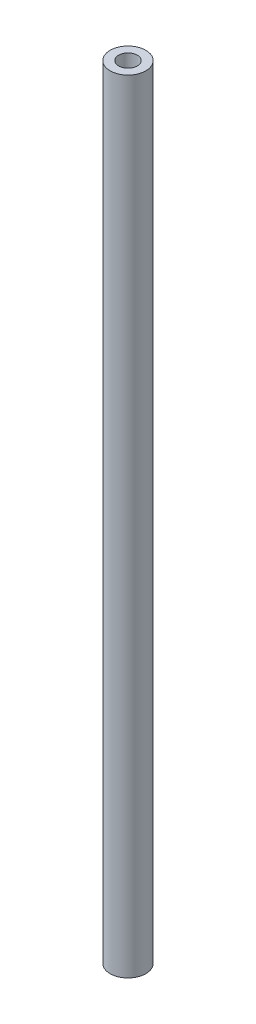
ISO-10303-21;
HEADER;
FILE_DESCRIPTION(('STEP AP214'),'2;1');
FILE_NAME('part.step','',(''),(''),'','','');
FILE_SCHEMA(('AUTOMOTIVE_DESIGN { 1 0 10303 214 1 1 1 1 }'));
ENDSEC;
DATA;
#1=APPLICATION_CONTEXT('core data for automotive mechanical design processes');
#2=APPLICATION_PROTOCOL_DEFINITION('international standard','automotive_design',2000,#1);
#3=PRODUCT_CONTEXT('',#1,'mechanical');
#4=PRODUCT('Part','Part','',(#3));
#5=PRODUCT_RELATED_PRODUCT_CATEGORY('part','',(#4));
#6=PRODUCT_DEFINITION_FORMATION('','',#4);
#7=PRODUCT_DEFINITION_CONTEXT('part definition',#1,'design');
#8=PRODUCT_DEFINITION('design','',#6,#7);
#9=PRODUCT_DEFINITION_SHAPE('','',#8);
#10=(LENGTH_UNIT() NAMED_UNIT(*) SI_UNIT(.MILLI.,.METRE.));
#11=(NAMED_UNIT(*) PLANE_ANGLE_UNIT() SI_UNIT($,.RADIAN.));
#12=(NAMED_UNIT(*) SI_UNIT($,.STERADIAN.) SOLID_ANGLE_UNIT());
#13=UNCERTAINTY_MEASURE_WITH_UNIT(LENGTH_MEASURE(1.E-05),#10,'distance_accuracy_value','');
#14=(GEOMETRIC_REPRESENTATION_CONTEXT(3) GLOBAL_UNCERTAINTY_ASSIGNED_CONTEXT((#13)) GLOBAL_UNIT_ASSIGNED_CONTEXT((#10,
#11,#12)) REPRESENTATION_CONTEXT('',''));
#15=CARTESIAN_POINT('',(0.,0.,0.));
#16=DIRECTION('',(0.,0.,1.));
#17=DIRECTION('',(1.,0.,0.));
#18=AXIS2_PLACEMENT_3D('',#15,#16,#17);
#19=CARTESIAN_POINT('',(0.,175.5,0.));
#20=DIRECTION('',(0.,-1.,0.));
#21=DIRECTION('',(0.,0.,-1.));
#22=AXIS2_PLACEMENT_3D('',#19,#20,#21);
#23=CYLINDRICAL_SURFACE('',#22,4.);
#24=CARTESIAN_POINT('',(0.,175.5,0.));
#25=DIRECTION('',(0.,1.,0.));
#26=DIRECTION('',(0.,0.,1.));
#27=AXIS2_PLACEMENT_3D('',#24,#25,#26);
#28=CIRCLE('',#27,4.);
#29=CARTESIAN_POINT('',(0.,175.5,4.));
#30=VERTEX_POINT('',#29);
#31=EDGE_CURVE('E10',#30,#30,#28,.T.);
#32=ORIENTED_EDGE('',*,*,#31,.F.);
#33=EDGE_LOOP('',(#32));
#34=FACE_BOUND('',#33,.T.);
#35=CARTESIAN_POINT('',(0.,0.,0.));
#36=DIRECTION('',(0.,1.,0.));
#37=DIRECTION('',(0.,0.,1.));
#38=AXIS2_PLACEMENT_3D('',#35,#36,#37);
#39=CIRCLE('',#38,4.);
#40=CARTESIAN_POINT('',(0.,0.,4.));
#41=VERTEX_POINT('',#40);
#42=EDGE_CURVE('E34',#41,#41,#39,.T.);
#43=ORIENTED_EDGE('',*,*,#42,.T.);
#44=EDGE_LOOP('',(#43));
#45=FACE_BOUND('',#44,.T.);
#46=ADVANCED_FACE('F31',(#34,#45),#23,.T.);
#47=CARTESIAN_POINT('',(0.,175.5,0.));
#48=DIRECTION('',(0.,1.,0.));
#49=DIRECTION('',(0.,0.,1.));
#50=AXIS2_PLACEMENT_3D('',#47,#48,#49);
#51=PLANE('',#50);
#52=CARTESIAN_POINT('',(0.,175.5,0.));
#53=DIRECTION('',(0.,1.,0.));
#54=DIRECTION('',(0.,0.,1.));
#55=AXIS2_PLACEMENT_3D('',#52,#53,#54);
#56=CIRCLE('',#55,2.1);
#57=CARTESIAN_POINT('',(0.,175.5,2.1));
#58=VERTEX_POINT('',#57);
#59=EDGE_CURVE('E43',#58,#58,#56,.T.);
#60=ORIENTED_EDGE('',*,*,#59,.F.);
#61=EDGE_LOOP('',(#60));
#62=FACE_BOUND('',#61,.T.);
#63=ORIENTED_EDGE('',*,*,#31,.T.);
#64=EDGE_LOOP('',(#63));
#65=FACE_BOUND('',#64,.T.);
#66=ADVANCED_FACE('F68',(#62,#65),#51,.T.);
#67=CARTESIAN_POINT('',(0.,0.,0.));
#68=DIRECTION('',(0.,1.,0.));
#69=DIRECTION('',(0.,0.,1.));
#70=AXIS2_PLACEMENT_3D('',#67,#68,#69);
#71=PLANE('',#70);
#72=CARTESIAN_POINT('',(0.,0.,0.));
#73=DIRECTION('',(0.,-1.,0.));
#74=DIRECTION('',(0.,0.,-1.));
#75=AXIS2_PLACEMENT_3D('',#72,#73,#74);
#76=CIRCLE('',#75,2.1);
#77=CARTESIAN_POINT('',(0.,0.,-2.1));
#78=VERTEX_POINT('',#77);
#79=EDGE_CURVE('E49',#78,#78,#76,.T.);
#80=ORIENTED_EDGE('',*,*,#79,.F.);
#81=EDGE_LOOP('',(#80));
#82=FACE_BOUND('',#81,.T.);
#83=ORIENTED_EDGE('',*,*,#42,.F.);
#84=EDGE_LOOP('',(#83));
#85=FACE_BOUND('',#84,.T.);
#86=ADVANCED_FACE('F64',(#82,#85),#71,.F.);
#87=CARTESIAN_POINT('',(0.,169.5,0.));
#88=DIRECTION('',(0.,1.,0.));
#89=DIRECTION('',(0.,0.,1.));
#90=AXIS2_PLACEMENT_3D('',#87,#88,#89);
#91=CYLINDRICAL_SURFACE('',#90,2.1);
#92=CARTESIAN_POINT('',(0.,169.5,0.));
#93=DIRECTION('',(0.,1.,0.));
#94=DIRECTION('',(0.,0.,1.));
#95=AXIS2_PLACEMENT_3D('',#92,#93,#94);
#96=CIRCLE('',#95,2.1);
#97=CARTESIAN_POINT('',(0.,169.5,2.1));
#98=VERTEX_POINT('',#97);
#99=EDGE_CURVE('E41',#98,#98,#96,.T.);
#100=ORIENTED_EDGE('',*,*,#99,.F.);
#101=EDGE_LOOP('',(#100));
#102=FACE_BOUND('',#101,.T.);
#103=ORIENTED_EDGE('',*,*,#59,.T.);
#104=EDGE_LOOP('',(#103));
#105=FACE_BOUND('',#104,.T.);
#106=ADVANCED_FACE('F67',(#102,#105),#91,.F.);
#107=CARTESIAN_POINT('',(0.,169.5,0.));
#108=DIRECTION('',(0.,1.,0.));
#109=DIRECTION('',(0.,0.,1.));
#110=AXIS2_PLACEMENT_3D('',#107,#108,#109);
#111=PLANE('',#110);
#112=ORIENTED_EDGE('',*,*,#99,.T.);
#113=EDGE_LOOP('',(#112));
#114=FACE_BOUND('',#113,.T.);
#115=ADVANCED_FACE('F60',(#114),#111,.T.);
#116=CARTESIAN_POINT('',(0.,6.,0.));
#117=DIRECTION('',(0.,-1.,0.));
#118=DIRECTION('',(0.,0.,-1.));
#119=AXIS2_PLACEMENT_3D('',#116,#117,#118);
#120=CYLINDRICAL_SURFACE('',#119,2.1);
#121=CARTESIAN_POINT('',(0.,6.,0.));
#122=DIRECTION('',(0.,-1.,0.));
#123=DIRECTION('',(0.,0.,-1.));
#124=AXIS2_PLACEMENT_3D('',#121,#122,#123);
#125=CIRCLE('',#124,2.1);
#126=CARTESIAN_POINT('',(0.,6.,-2.1));
#127=VERTEX_POINT('',#126);
#128=EDGE_CURVE('E46',#127,#127,#125,.T.);
#129=ORIENTED_EDGE('',*,*,#128,.F.);
#130=EDGE_LOOP('',(#129));
#131=FACE_BOUND('',#130,.T.);
#132=ORIENTED_EDGE('',*,*,#79,.T.);
#133=EDGE_LOOP('',(#132));
#134=FACE_BOUND('',#133,.T.);
#135=ADVANCED_FACE('F57',(#131,#134),#120,.F.);
#136=CARTESIAN_POINT('',(0.,6.,0.));
#137=DIRECTION('',(0.,-1.,0.));
#138=DIRECTION('',(0.,0.,-1.));
#139=AXIS2_PLACEMENT_3D('',#136,#137,#138);
#140=PLANE('',#139);
#141=ORIENTED_EDGE('',*,*,#128,.T.);
#142=EDGE_LOOP('',(#141));
#143=FACE_BOUND('',#142,.T.);
#144=ADVANCED_FACE('F55',(#143),#140,.T.);
#145=CLOSED_SHELL('',(#46,#66,#86,#106,#115,#135,#144));
#146=MANIFOLD_SOLID_BREP('B2',#145);
#147=ADVANCED_BREP_SHAPE_REPRESENTATION('',(#18,#146),#14);
#148=SHAPE_DEFINITION_REPRESENTATION(#9,#147);
ENDSEC;
END-ISO-10303-21;
